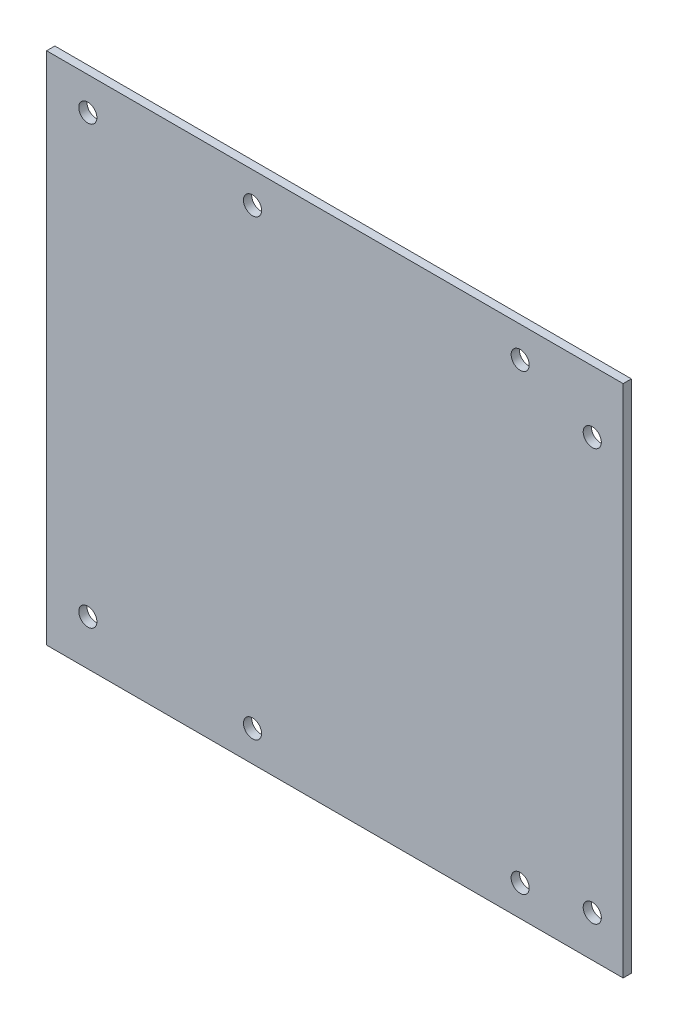
ISO-10303-21;
HEADER;
FILE_DESCRIPTION(('STEP AP214'),'2;1');
FILE_NAME('part.step','',(''),(''),'','','');
FILE_SCHEMA(('AUTOMOTIVE_DESIGN { 1 0 10303 214 1 1 1 1 }'));
ENDSEC;
DATA;
#1=APPLICATION_CONTEXT('core data for automotive mechanical design processes');
#2=APPLICATION_PROTOCOL_DEFINITION('international standard','automotive_design',2000,#1);
#3=PRODUCT_CONTEXT('',#1,'mechanical');
#4=PRODUCT('Part','Part','',(#3));
#5=PRODUCT_RELATED_PRODUCT_CATEGORY('part','',(#4));
#6=PRODUCT_DEFINITION_FORMATION('','',#4);
#7=PRODUCT_DEFINITION_CONTEXT('part definition',#1,'design');
#8=PRODUCT_DEFINITION('design','',#6,#7);
#9=PRODUCT_DEFINITION_SHAPE('','',#8);
#10=(LENGTH_UNIT() NAMED_UNIT(*) SI_UNIT(.MILLI.,.METRE.));
#11=(NAMED_UNIT(*) PLANE_ANGLE_UNIT() SI_UNIT($,.RADIAN.));
#12=(NAMED_UNIT(*) SI_UNIT($,.STERADIAN.) SOLID_ANGLE_UNIT());
#13=UNCERTAINTY_MEASURE_WITH_UNIT(LENGTH_MEASURE(1.E-05),#10,'distance_accuracy_value','');
#14=(GEOMETRIC_REPRESENTATION_CONTEXT(3) GLOBAL_UNCERTAINTY_ASSIGNED_CONTEXT((#13)) GLOBAL_UNIT_ASSIGNED_CONTEXT((#10,
#11,#12)) REPRESENTATION_CONTEXT('',''));
#15=CARTESIAN_POINT('',(0.,0.,0.));
#16=DIRECTION('',(0.,0.,1.));
#17=DIRECTION('',(1.,0.,0.));
#18=AXIS2_PLACEMENT_3D('',#15,#16,#17);
#19=CARTESIAN_POINT('',(70.,62.5,2.));
#20=DIRECTION('',(-1.,0.,0.));
#21=DIRECTION('',(0.,-1.,0.));
#22=AXIS2_PLACEMENT_3D('',#19,#20,#21);
#23=PLANE('',#22);
#24=DIRECTION('',(0.,1.,0.));
#25=VECTOR('',#24,1.);
#26=CARTESIAN_POINT('',(70.,62.5,0.));
#27=LINE('',#26,#25);
#28=CARTESIAN_POINT('',(70.,-62.5,0.));
#29=VERTEX_POINT('',#28);
#30=CARTESIAN_POINT('',(70.,62.5,0.));
#31=VERTEX_POINT('',#30);
#32=EDGE_CURVE('E110',#29,#31,#27,.T.);
#33=ORIENTED_EDGE('',*,*,#32,.T.);
#34=DIRECTION('',(0.,0.,-1.));
#35=VECTOR('',#34,1.);
#36=CARTESIAN_POINT('',(70.,62.5,2.));
#37=LINE('',#36,#35);
#38=CARTESIAN_POINT('',(70.,62.5,2.));
#39=VERTEX_POINT('',#38);
#40=EDGE_CURVE('E11',#39,#31,#37,.T.);
#41=ORIENTED_EDGE('',*,*,#40,.F.);
#42=DIRECTION('',(0.,1.,0.));
#43=VECTOR('',#42,1.);
#44=CARTESIAN_POINT('',(70.,62.5,2.));
#45=LINE('',#44,#43);
#46=CARTESIAN_POINT('',(70.,-62.5,2.));
#47=VERTEX_POINT('',#46);
#48=EDGE_CURVE('E93',#47,#39,#45,.T.);
#49=ORIENTED_EDGE('',*,*,#48,.F.);
#50=DIRECTION('',(0.,0.,-1.));
#51=VECTOR('',#50,1.);
#52=CARTESIAN_POINT('',(70.,-62.5,2.));
#53=LINE('',#52,#51);
#54=EDGE_CURVE('E106',#47,#29,#53,.T.);
#55=ORIENTED_EDGE('',*,*,#54,.T.);
#56=EDGE_LOOP('',(#33,#41,#49,#55));
#57=FACE_BOUND('',#56,.T.);
#58=ADVANCED_FACE('F39',(#57),#23,.F.);
#59=CARTESIAN_POINT('',(-70.,62.5,2.));
#60=DIRECTION('',(0.,-1.,0.));
#61=DIRECTION('',(0.,0.,-1.));
#62=AXIS2_PLACEMENT_3D('',#59,#60,#61);
#63=PLANE('',#62);
#64=DIRECTION('',(-1.,0.,0.));
#65=VECTOR('',#64,1.);
#66=CARTESIAN_POINT('',(-70.,62.5,0.));
#67=LINE('',#66,#65);
#68=CARTESIAN_POINT('',(-70.,62.5,0.));
#69=VERTEX_POINT('',#68);
#70=EDGE_CURVE('E98',#31,#69,#67,.T.);
#71=ORIENTED_EDGE('',*,*,#70,.T.);
#72=DIRECTION('',(0.,0.,-1.));
#73=VECTOR('',#72,1.);
#74=CARTESIAN_POINT('',(-70.,62.5,2.));
#75=LINE('',#74,#73);
#76=CARTESIAN_POINT('',(-70.,62.5,2.));
#77=VERTEX_POINT('',#76);
#78=EDGE_CURVE('E49',#77,#69,#75,.T.);
#79=ORIENTED_EDGE('',*,*,#78,.F.);
#80=DIRECTION('',(-1.,0.,0.));
#81=VECTOR('',#80,1.);
#82=CARTESIAN_POINT('',(-70.,62.5,2.));
#83=LINE('',#82,#81);
#84=EDGE_CURVE('E88',#39,#77,#83,.T.);
#85=ORIENTED_EDGE('',*,*,#84,.F.);
#86=ORIENTED_EDGE('',*,*,#40,.T.);
#87=EDGE_LOOP('',(#71,#79,#85,#86));
#88=FACE_BOUND('',#87,.T.);
#89=ADVANCED_FACE('F97',(#88),#63,.F.);
#90=CARTESIAN_POINT('',(-70.,62.5,2.));
#91=DIRECTION('',(1.,0.,0.));
#92=DIRECTION('',(0.,0.,-1.));
#93=AXIS2_PLACEMENT_3D('',#90,#91,#92);
#94=PLANE('',#93);
#95=DIRECTION('',(0.,-1.,0.));
#96=VECTOR('',#95,1.);
#97=CARTESIAN_POINT('',(-70.,62.5,0.));
#98=LINE('',#97,#96);
#99=CARTESIAN_POINT('',(-70.,-62.5,0.));
#100=VERTEX_POINT('',#99);
#101=EDGE_CURVE('E75',#69,#100,#98,.T.);
#102=ORIENTED_EDGE('',*,*,#101,.T.);
#103=DIRECTION('',(0.,0.,-1.));
#104=VECTOR('',#103,1.);
#105=CARTESIAN_POINT('',(-70.,-62.5,2.));
#106=LINE('',#105,#104);
#107=CARTESIAN_POINT('',(-70.,-62.5,2.));
#108=VERTEX_POINT('',#107);
#109=EDGE_CURVE('E100',#108,#100,#106,.T.);
#110=ORIENTED_EDGE('',*,*,#109,.F.);
#111=DIRECTION('',(0.,-1.,0.));
#112=VECTOR('',#111,1.);
#113=CARTESIAN_POINT('',(-70.,62.5,2.));
#114=LINE('',#113,#112);
#115=EDGE_CURVE('E91',#77,#108,#114,.T.);
#116=ORIENTED_EDGE('',*,*,#115,.F.);
#117=ORIENTED_EDGE('',*,*,#78,.T.);
#118=EDGE_LOOP('',(#102,#110,#116,#117));
#119=FACE_BOUND('',#118,.T.);
#120=ADVANCED_FACE('F102',(#119),#94,.F.);
#121=CARTESIAN_POINT('',(-70.,-62.5,2.));
#122=DIRECTION('',(0.,1.,0.));
#123=DIRECTION('',(0.,0.,1.));
#124=AXIS2_PLACEMENT_3D('',#121,#122,#123);
#125=PLANE('',#124);
#126=DIRECTION('',(1.,0.,0.));
#127=VECTOR('',#126,1.);
#128=CARTESIAN_POINT('',(-70.,-62.5,0.));
#129=LINE('',#128,#127);
#130=EDGE_CURVE('E81',#100,#29,#129,.T.);
#131=ORIENTED_EDGE('',*,*,#130,.T.);
#132=ORIENTED_EDGE('',*,*,#54,.F.);
#133=DIRECTION('',(1.,0.,0.));
#134=VECTOR('',#133,1.);
#135=CARTESIAN_POINT('',(-70.,-62.5,2.));
#136=LINE('',#135,#134);
#137=EDGE_CURVE('E58',#108,#47,#136,.T.);
#138=ORIENTED_EDGE('',*,*,#137,.F.);
#139=ORIENTED_EDGE('',*,*,#109,.T.);
#140=EDGE_LOOP('',(#131,#132,#138,#139));
#141=FACE_BOUND('',#140,.T.);
#142=ADVANCED_FACE('F201',(#141),#125,.F.);
#143=CARTESIAN_POINT('',(0.,0.,2.));
#144=DIRECTION('',(0.,0.,1.));
#145=DIRECTION('',(1.,0.,0.));
#146=AXIS2_PLACEMENT_3D('',#143,#144,#145);
#147=PLANE('',#146);
#148=CARTESIAN_POINT('',(45.,-55.,2.));
#149=DIRECTION('',(0.,0.,1.));
#150=DIRECTION('',(1.,0.,0.));
#151=AXIS2_PLACEMENT_3D('',#148,#149,#150);
#152=CIRCLE('',#151,2.2);
#153=CARTESIAN_POINT('',(47.2,-55.,2.));
#154=VERTEX_POINT('',#153);
#155=EDGE_CURVE('E183',#154,#154,#152,.T.);
#156=ORIENTED_EDGE('',*,*,#155,.F.);
#157=EDGE_LOOP('',(#156));
#158=FACE_BOUND('',#157,.T.);
#159=CARTESIAN_POINT('',(-20.,-55.,2.));
#160=DIRECTION('',(0.,0.,1.));
#161=DIRECTION('',(1.,0.,0.));
#162=AXIS2_PLACEMENT_3D('',#159,#160,#161);
#163=CIRCLE('',#162,2.2);
#164=CARTESIAN_POINT('',(-17.8,-55.,2.));
#165=VERTEX_POINT('',#164);
#166=EDGE_CURVE('E187',#165,#165,#163,.T.);
#167=ORIENTED_EDGE('',*,*,#166,.F.);
#168=EDGE_LOOP('',(#167));
#169=FACE_BOUND('',#168,.T.);
#170=CARTESIAN_POINT('',(-20.,55.,2.));
#171=DIRECTION('',(0.,0.,1.));
#172=DIRECTION('',(1.,0.,0.));
#173=AXIS2_PLACEMENT_3D('',#170,#171,#172);
#174=CIRCLE('',#173,2.20000000000001);
#175=CARTESIAN_POINT('',(-17.8,55.,2.));
#176=VERTEX_POINT('',#175);
#177=EDGE_CURVE('E182',#176,#176,#174,.T.);
#178=ORIENTED_EDGE('',*,*,#177,.F.);
#179=EDGE_LOOP('',(#178));
#180=FACE_BOUND('',#179,.T.);
#181=CARTESIAN_POINT('',(45.,55.,2.));
#182=DIRECTION('',(0.,0.,1.));
#183=DIRECTION('',(1.,0.,0.));
#184=AXIS2_PLACEMENT_3D('',#181,#182,#183);
#185=CIRCLE('',#184,2.20000000000001);
#186=CARTESIAN_POINT('',(47.2,55.,2.));
#187=VERTEX_POINT('',#186);
#188=EDGE_CURVE('E130',#187,#187,#185,.T.);
#189=ORIENTED_EDGE('',*,*,#188,.F.);
#190=EDGE_LOOP('',(#189));
#191=FACE_BOUND('',#190,.T.);
#192=CARTESIAN_POINT('',(62.5,47.5,2.));
#193=DIRECTION('',(0.,0.,1.));
#194=DIRECTION('',(1.,0.,0.));
#195=AXIS2_PLACEMENT_3D('',#192,#193,#194);
#196=CIRCLE('',#195,2.2);
#197=CARTESIAN_POINT('',(64.7,47.5,2.));
#198=VERTEX_POINT('',#197);
#199=EDGE_CURVE('E151',#198,#198,#196,.T.);
#200=ORIENTED_EDGE('',*,*,#199,.F.);
#201=EDGE_LOOP('',(#200));
#202=FACE_BOUND('',#201,.T.);
#203=CARTESIAN_POINT('',(62.5,-52.5,2.));
#204=DIRECTION('',(0.,0.,1.));
#205=DIRECTION('',(1.,0.,0.));
#206=AXIS2_PLACEMENT_3D('',#203,#204,#205);
#207=CIRCLE('',#206,2.2);
#208=CARTESIAN_POINT('',(64.7,-52.5,2.));
#209=VERTEX_POINT('',#208);
#210=EDGE_CURVE('E140',#209,#209,#207,.T.);
#211=ORIENTED_EDGE('',*,*,#210,.F.);
#212=EDGE_LOOP('',(#211));
#213=FACE_BOUND('',#212,.T.);
#214=CARTESIAN_POINT('',(-60.,54.5,2.));
#215=DIRECTION('',(0.,0.,1.));
#216=DIRECTION('',(1.,0.,0.));
#217=AXIS2_PLACEMENT_3D('',#214,#215,#216);
#218=CIRCLE('',#217,2.2);
#219=CARTESIAN_POINT('',(-57.8,54.5,2.));
#220=VERTEX_POINT('',#219);
#221=EDGE_CURVE('E158',#220,#220,#218,.T.);
#222=ORIENTED_EDGE('',*,*,#221,.F.);
#223=EDGE_LOOP('',(#222));
#224=FACE_BOUND('',#223,.T.);
#225=CARTESIAN_POINT('',(-60.,-51.5,2.));
#226=DIRECTION('',(0.,0.,1.));
#227=DIRECTION('',(1.,0.,0.));
#228=AXIS2_PLACEMENT_3D('',#225,#226,#227);
#229=CIRCLE('',#228,2.2);
#230=CARTESIAN_POINT('',(-57.8,-51.5,2.));
#231=VERTEX_POINT('',#230);
#232=EDGE_CURVE('E166',#231,#231,#229,.T.);
#233=ORIENTED_EDGE('',*,*,#232,.F.);
#234=EDGE_LOOP('',(#233));
#235=FACE_BOUND('',#234,.T.);
#236=ORIENTED_EDGE('',*,*,#48,.T.);
#237=ORIENTED_EDGE('',*,*,#84,.T.);
#238=ORIENTED_EDGE('',*,*,#115,.T.);
#239=ORIENTED_EDGE('',*,*,#137,.T.);
#240=EDGE_LOOP('',(#236,#237,#238,#239));
#241=FACE_BOUND('',#240,.T.);
#242=ADVANCED_FACE('F89',(#158,#169,#180,#191,#202,#213,#224,#235,#241),#147,.T.);
#243=CARTESIAN_POINT('',(0.,0.,0.));
#244=DIRECTION('',(0.,0.,1.));
#245=DIRECTION('',(1.,0.,0.));
#246=AXIS2_PLACEMENT_3D('',#243,#244,#245);
#247=PLANE('',#246);
#248=CARTESIAN_POINT('',(45.,-55.,0.));
#249=DIRECTION('',(0.,0.,1.));
#250=DIRECTION('',(1.,0.,0.));
#251=AXIS2_PLACEMENT_3D('',#248,#249,#250);
#252=CIRCLE('',#251,2.2);
#253=CARTESIAN_POINT('',(47.2,-55.,0.));
#254=VERTEX_POINT('',#253);
#255=EDGE_CURVE('E42',#254,#254,#252,.T.);
#256=ORIENTED_EDGE('',*,*,#255,.T.);
#257=EDGE_LOOP('',(#256));
#258=FACE_BOUND('',#257,.T.);
#259=CARTESIAN_POINT('',(-20.,-55.,0.));
#260=DIRECTION('',(0.,0.,1.));
#261=DIRECTION('',(1.,0.,0.));
#262=AXIS2_PLACEMENT_3D('',#259,#260,#261);
#263=CIRCLE('',#262,2.2);
#264=CARTESIAN_POINT('',(-17.8,-55.,0.));
#265=VERTEX_POINT('',#264);
#266=EDGE_CURVE('E133',#265,#265,#263,.T.);
#267=ORIENTED_EDGE('',*,*,#266,.T.);
#268=EDGE_LOOP('',(#267));
#269=FACE_BOUND('',#268,.T.);
#270=CARTESIAN_POINT('',(-20.,55.,0.));
#271=DIRECTION('',(0.,0.,1.));
#272=DIRECTION('',(1.,0.,0.));
#273=AXIS2_PLACEMENT_3D('',#270,#271,#272);
#274=CIRCLE('',#273,2.20000000000001);
#275=CARTESIAN_POINT('',(-17.8,55.,0.));
#276=VERTEX_POINT('',#275);
#277=EDGE_CURVE('E129',#276,#276,#274,.T.);
#278=ORIENTED_EDGE('',*,*,#277,.T.);
#279=EDGE_LOOP('',(#278));
#280=FACE_BOUND('',#279,.T.);
#281=CARTESIAN_POINT('',(45.,55.,0.));
#282=DIRECTION('',(0.,0.,1.));
#283=DIRECTION('',(1.,0.,0.));
#284=AXIS2_PLACEMENT_3D('',#281,#282,#283);
#285=CIRCLE('',#284,2.20000000000001);
#286=CARTESIAN_POINT('',(47.2,55.,0.));
#287=VERTEX_POINT('',#286);
#288=EDGE_CURVE('E125',#287,#287,#285,.T.);
#289=ORIENTED_EDGE('',*,*,#288,.T.);
#290=EDGE_LOOP('',(#289));
#291=FACE_BOUND('',#290,.T.);
#292=CARTESIAN_POINT('',(62.5,47.5,0.));
#293=DIRECTION('',(0.,0.,1.));
#294=DIRECTION('',(1.,0.,0.));
#295=AXIS2_PLACEMENT_3D('',#292,#293,#294);
#296=CIRCLE('',#295,2.2);
#297=CARTESIAN_POINT('',(64.7,47.5,0.));
#298=VERTEX_POINT('',#297);
#299=EDGE_CURVE('E169',#298,#298,#296,.T.);
#300=ORIENTED_EDGE('',*,*,#299,.T.);
#301=EDGE_LOOP('',(#300));
#302=FACE_BOUND('',#301,.T.);
#303=CARTESIAN_POINT('',(62.5,-52.5,0.));
#304=DIRECTION('',(0.,0.,1.));
#305=DIRECTION('',(1.,0.,0.));
#306=AXIS2_PLACEMENT_3D('',#303,#304,#305);
#307=CIRCLE('',#306,2.2);
#308=CARTESIAN_POINT('',(64.7,-52.5,0.));
#309=VERTEX_POINT('',#308);
#310=EDGE_CURVE('E145',#309,#309,#307,.T.);
#311=ORIENTED_EDGE('',*,*,#310,.T.);
#312=EDGE_LOOP('',(#311));
#313=FACE_BOUND('',#312,.T.);
#314=CARTESIAN_POINT('',(-60.,54.5,0.));
#315=DIRECTION('',(0.,0.,1.));
#316=DIRECTION('',(1.,0.,0.));
#317=AXIS2_PLACEMENT_3D('',#314,#315,#316);
#318=CIRCLE('',#317,2.2);
#319=CARTESIAN_POINT('',(-57.8,54.5,0.));
#320=VERTEX_POINT('',#319);
#321=EDGE_CURVE('E114',#320,#320,#318,.T.);
#322=ORIENTED_EDGE('',*,*,#321,.T.);
#323=EDGE_LOOP('',(#322));
#324=FACE_BOUND('',#323,.T.);
#325=CARTESIAN_POINT('',(-60.,-51.5,0.));
#326=DIRECTION('',(0.,0.,1.));
#327=DIRECTION('',(1.,0.,0.));
#328=AXIS2_PLACEMENT_3D('',#325,#326,#327);
#329=CIRCLE('',#328,2.2);
#330=CARTESIAN_POINT('',(-57.8,-51.5,0.));
#331=VERTEX_POINT('',#330);
#332=EDGE_CURVE('E162',#331,#331,#329,.T.);
#333=ORIENTED_EDGE('',*,*,#332,.T.);
#334=EDGE_LOOP('',(#333));
#335=FACE_BOUND('',#334,.T.);
#336=ORIENTED_EDGE('',*,*,#32,.F.);
#337=ORIENTED_EDGE('',*,*,#130,.F.);
#338=ORIENTED_EDGE('',*,*,#101,.F.);
#339=ORIENTED_EDGE('',*,*,#70,.F.);
#340=EDGE_LOOP('',(#336,#337,#338,#339));
#341=FACE_BOUND('',#340,.T.);
#342=ADVANCED_FACE('F200',(#258,#269,#280,#291,#302,#313,#324,#335,#341),#247,.F.);
#343=CARTESIAN_POINT('',(-60.,-51.5,0.));
#344=DIRECTION('',(0.,0.,1.));
#345=DIRECTION('',(1.,0.,0.));
#346=AXIS2_PLACEMENT_3D('',#343,#344,#345);
#347=CYLINDRICAL_SURFACE('',#346,2.2);
#348=ORIENTED_EDGE('',*,*,#332,.F.);
#349=EDGE_LOOP('',(#348));
#350=FACE_BOUND('',#349,.T.);
#351=ORIENTED_EDGE('',*,*,#232,.T.);
#352=EDGE_LOOP('',(#351));
#353=FACE_BOUND('',#352,.T.);
#354=ADVANCED_FACE('F212',(#350,#353),#347,.F.);
#355=CARTESIAN_POINT('',(-60.,54.5,0.));
#356=DIRECTION('',(0.,0.,1.));
#357=DIRECTION('',(1.,0.,0.));
#358=AXIS2_PLACEMENT_3D('',#355,#356,#357);
#359=CYLINDRICAL_SURFACE('',#358,2.2);
#360=ORIENTED_EDGE('',*,*,#321,.F.);
#361=EDGE_LOOP('',(#360));
#362=FACE_BOUND('',#361,.T.);
#363=ORIENTED_EDGE('',*,*,#221,.T.);
#364=EDGE_LOOP('',(#363));
#365=FACE_BOUND('',#364,.T.);
#366=ADVANCED_FACE('F214',(#362,#365),#359,.F.);
#367=CARTESIAN_POINT('',(62.5,-52.5,0.));
#368=DIRECTION('',(0.,0.,1.));
#369=DIRECTION('',(1.,0.,0.));
#370=AXIS2_PLACEMENT_3D('',#367,#368,#369);
#371=CYLINDRICAL_SURFACE('',#370,2.2);
#372=ORIENTED_EDGE('',*,*,#310,.F.);
#373=EDGE_LOOP('',(#372));
#374=FACE_BOUND('',#373,.T.);
#375=ORIENTED_EDGE('',*,*,#210,.T.);
#376=EDGE_LOOP('',(#375));
#377=FACE_BOUND('',#376,.T.);
#378=ADVANCED_FACE('F221',(#374,#377),#371,.F.);
#379=CARTESIAN_POINT('',(62.5,47.5,0.));
#380=DIRECTION('',(0.,0.,1.));
#381=DIRECTION('',(1.,0.,0.));
#382=AXIS2_PLACEMENT_3D('',#379,#380,#381);
#383=CYLINDRICAL_SURFACE('',#382,2.2);
#384=ORIENTED_EDGE('',*,*,#299,.F.);
#385=EDGE_LOOP('',(#384));
#386=FACE_BOUND('',#385,.T.);
#387=ORIENTED_EDGE('',*,*,#199,.T.);
#388=EDGE_LOOP('',(#387));
#389=FACE_BOUND('',#388,.T.);
#390=ADVANCED_FACE('F286',(#386,#389),#383,.F.);
#391=CARTESIAN_POINT('',(45.,55.,-103.));
#392=DIRECTION('',(0.,0.,1.));
#393=DIRECTION('',(1.,0.,0.));
#394=AXIS2_PLACEMENT_3D('',#391,#392,#393);
#395=CYLINDRICAL_SURFACE('',#394,2.20000000000001);
#396=ORIENTED_EDGE('',*,*,#188,.T.);
#397=EDGE_LOOP('',(#396));
#398=FACE_BOUND('',#397,.T.);
#399=ORIENTED_EDGE('',*,*,#288,.F.);
#400=EDGE_LOOP('',(#399));
#401=FACE_BOUND('',#400,.T.);
#402=ADVANCED_FACE('F294',(#398,#401),#395,.F.);
#403=CARTESIAN_POINT('',(-20.,55.,-103.));
#404=DIRECTION('',(0.,0.,1.));
#405=DIRECTION('',(1.,0.,0.));
#406=AXIS2_PLACEMENT_3D('',#403,#404,#405);
#407=CYLINDRICAL_SURFACE('',#406,2.20000000000001);
#408=ORIENTED_EDGE('',*,*,#177,.T.);
#409=EDGE_LOOP('',(#408));
#410=FACE_BOUND('',#409,.T.);
#411=ORIENTED_EDGE('',*,*,#277,.F.);
#412=EDGE_LOOP('',(#411));
#413=FACE_BOUND('',#412,.T.);
#414=ADVANCED_FACE('F195',(#410,#413),#407,.F.);
#415=CARTESIAN_POINT('',(-20.,-55.,-103.));
#416=DIRECTION('',(0.,0.,1.));
#417=DIRECTION('',(1.,0.,0.));
#418=AXIS2_PLACEMENT_3D('',#415,#416,#417);
#419=CYLINDRICAL_SURFACE('',#418,2.2);
#420=ORIENTED_EDGE('',*,*,#166,.T.);
#421=EDGE_LOOP('',(#420));
#422=FACE_BOUND('',#421,.T.);
#423=ORIENTED_EDGE('',*,*,#266,.F.);
#424=EDGE_LOOP('',(#423));
#425=FACE_BOUND('',#424,.T.);
#426=ADVANCED_FACE('F310',(#422,#425),#419,.F.);
#427=CARTESIAN_POINT('',(45.,-55.,-103.));
#428=DIRECTION('',(0.,0.,1.));
#429=DIRECTION('',(1.,0.,0.));
#430=AXIS2_PLACEMENT_3D('',#427,#428,#429);
#431=CYLINDRICAL_SURFACE('',#430,2.2);
#432=ORIENTED_EDGE('',*,*,#155,.T.);
#433=EDGE_LOOP('',(#432));
#434=FACE_BOUND('',#433,.T.);
#435=ORIENTED_EDGE('',*,*,#255,.F.);
#436=EDGE_LOOP('',(#435));
#437=FACE_BOUND('',#436,.T.);
#438=ADVANCED_FACE('F318',(#434,#437),#431,.F.);
#439=CLOSED_SHELL('',(#58,#89,#120,#142,#242,#342,#354,#366,#378,#390,#402,#414,#426,#438));
#440=MANIFOLD_SOLID_BREP('B2',#439);
#441=ADVANCED_BREP_SHAPE_REPRESENTATION('',(#18,#440),#14);
#442=SHAPE_DEFINITION_REPRESENTATION(#9,#441);
ENDSEC;
END-ISO-10303-21;
